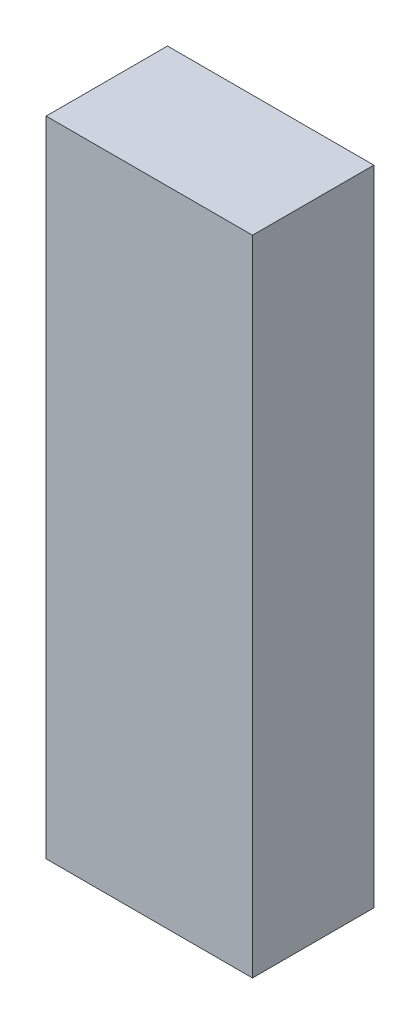
ISO-10303-21;
HEADER;
FILE_DESCRIPTION(('STEP AP214'),'2;1');
FILE_NAME('part.step','',(''),(''),'','','');
FILE_SCHEMA(('AUTOMOTIVE_DESIGN { 1 0 10303 214 1 1 1 1 }'));
ENDSEC;
DATA;
#1=APPLICATION_CONTEXT('core data for automotive mechanical design processes');
#2=APPLICATION_PROTOCOL_DEFINITION('international standard','automotive_design',2000,#1);
#3=PRODUCT_CONTEXT('',#1,'mechanical');
#4=PRODUCT('Part','Part','',(#3));
#5=PRODUCT_RELATED_PRODUCT_CATEGORY('part','',(#4));
#6=PRODUCT_DEFINITION_FORMATION('','',#4);
#7=PRODUCT_DEFINITION_CONTEXT('part definition',#1,'design');
#8=PRODUCT_DEFINITION('design','',#6,#7);
#9=PRODUCT_DEFINITION_SHAPE('','',#8);
#10=(LENGTH_UNIT() NAMED_UNIT(*) SI_UNIT(.MILLI.,.METRE.));
#11=(NAMED_UNIT(*) PLANE_ANGLE_UNIT() SI_UNIT($,.RADIAN.));
#12=(NAMED_UNIT(*) SI_UNIT($,.STERADIAN.) SOLID_ANGLE_UNIT());
#13=UNCERTAINTY_MEASURE_WITH_UNIT(LENGTH_MEASURE(1.E-05),#10,'distance_accuracy_value','');
#14=(GEOMETRIC_REPRESENTATION_CONTEXT(3) GLOBAL_UNCERTAINTY_ASSIGNED_CONTEXT((#13)) GLOBAL_UNIT_ASSIGNED_CONTEXT((#10,
#11,#12)) REPRESENTATION_CONTEXT('',''));
#15=CARTESIAN_POINT('',(0.,0.,0.));
#16=DIRECTION('',(0.,0.,1.));
#17=DIRECTION('',(1.,0.,0.));
#18=AXIS2_PLACEMENT_3D('',#15,#16,#17);
#19=CARTESIAN_POINT('',(0.,106.,20.));
#20=DIRECTION('',(1.,0.,0.));
#21=DIRECTION('',(0.,0.,-1.));
#22=AXIS2_PLACEMENT_3D('',#19,#20,#21);
#23=PLANE('',#22);
#24=DIRECTION('',(0.,-1.,0.));
#25=VECTOR('',#24,1.);
#26=CARTESIAN_POINT('',(0.,106.,0.));
#27=LINE('',#26,#25);
#28=CARTESIAN_POINT('',(0.,106.,0.));
#29=VERTEX_POINT('',#28);
#30=CARTESIAN_POINT('',(0.,0.,0.));
#31=VERTEX_POINT('',#30);
#32=EDGE_CURVE('E96',#29,#31,#27,.T.);
#33=ORIENTED_EDGE('',*,*,#32,.T.);
#34=DIRECTION('',(0.,0.,-1.));
#35=VECTOR('',#34,1.);
#36=CARTESIAN_POINT('',(0.,0.,20.));
#37=LINE('',#36,#35);
#38=CARTESIAN_POINT('',(0.,0.,20.));
#39=VERTEX_POINT('',#38);
#40=EDGE_CURVE('E11',#39,#31,#37,.T.);
#41=ORIENTED_EDGE('',*,*,#40,.F.);
#42=DIRECTION('',(0.,-1.,0.));
#43=VECTOR('',#42,1.);
#44=CARTESIAN_POINT('',(0.,106.,20.));
#45=LINE('',#44,#43);
#46=CARTESIAN_POINT('',(0.,106.,20.));
#47=VERTEX_POINT('',#46);
#48=EDGE_CURVE('E84',#47,#39,#45,.T.);
#49=ORIENTED_EDGE('',*,*,#48,.F.);
#50=DIRECTION('',(0.,0.,-1.));
#51=VECTOR('',#50,1.);
#52=CARTESIAN_POINT('',(0.,106.,20.));
#53=LINE('',#52,#51);
#54=EDGE_CURVE('E92',#47,#29,#53,.T.);
#55=ORIENTED_EDGE('',*,*,#54,.T.);
#56=EDGE_LOOP('',(#33,#41,#49,#55));
#57=FACE_BOUND('',#56,.T.);
#58=ADVANCED_FACE('F33',(#57),#23,.F.);
#59=CARTESIAN_POINT('',(0.,0.,20.));
#60=DIRECTION('',(0.,1.,0.));
#61=DIRECTION('',(0.,0.,1.));
#62=AXIS2_PLACEMENT_3D('',#59,#60,#61);
#63=PLANE('',#62);
#64=DIRECTION('',(1.,0.,0.));
#65=VECTOR('',#64,1.);
#66=CARTESIAN_POINT('',(0.,0.,0.));
#67=LINE('',#66,#65);
#68=CARTESIAN_POINT('',(34.,0.,0.));
#69=VERTEX_POINT('',#68);
#70=EDGE_CURVE('E88',#31,#69,#67,.T.);
#71=ORIENTED_EDGE('',*,*,#70,.T.);
#72=DIRECTION('',(0.,0.,-1.));
#73=VECTOR('',#72,1.);
#74=CARTESIAN_POINT('',(34.,0.,20.));
#75=LINE('',#74,#73);
#76=CARTESIAN_POINT('',(34.,0.,20.));
#77=VERTEX_POINT('',#76);
#78=EDGE_CURVE('E41',#77,#69,#75,.T.);
#79=ORIENTED_EDGE('',*,*,#78,.F.);
#80=DIRECTION('',(1.,0.,0.));
#81=VECTOR('',#80,1.);
#82=CARTESIAN_POINT('',(0.,0.,20.));
#83=LINE('',#82,#81);
#84=EDGE_CURVE('E79',#39,#77,#83,.T.);
#85=ORIENTED_EDGE('',*,*,#84,.F.);
#86=ORIENTED_EDGE('',*,*,#40,.T.);
#87=EDGE_LOOP('',(#71,#79,#85,#86));
#88=FACE_BOUND('',#87,.T.);
#89=ADVANCED_FACE('F87',(#88),#63,.F.);
#90=CARTESIAN_POINT('',(34.,0.,20.));
#91=DIRECTION('',(-1.,0.,0.));
#92=DIRECTION('',(0.,0.,1.));
#93=AXIS2_PLACEMENT_3D('',#90,#91,#92);
#94=PLANE('',#93);
#95=DIRECTION('',(0.,1.,0.));
#96=VECTOR('',#95,1.);
#97=CARTESIAN_POINT('',(34.,0.,0.));
#98=LINE('',#97,#96);
#99=CARTESIAN_POINT('',(34.,106.,0.));
#100=VERTEX_POINT('',#99);
#101=EDGE_CURVE('E66',#69,#100,#98,.T.);
#102=ORIENTED_EDGE('',*,*,#101,.T.);
#103=DIRECTION('',(0.,0.,-1.));
#104=VECTOR('',#103,1.);
#105=CARTESIAN_POINT('',(34.,106.,20.));
#106=LINE('',#105,#104);
#107=CARTESIAN_POINT('',(34.,106.,20.));
#108=VERTEX_POINT('',#107);
#109=EDGE_CURVE('E89',#108,#100,#106,.T.);
#110=ORIENTED_EDGE('',*,*,#109,.F.);
#111=DIRECTION('',(0.,1.,0.));
#112=VECTOR('',#111,1.);
#113=CARTESIAN_POINT('',(34.,0.,20.));
#114=LINE('',#113,#112);
#115=EDGE_CURVE('E82',#77,#108,#114,.T.);
#116=ORIENTED_EDGE('',*,*,#115,.F.);
#117=ORIENTED_EDGE('',*,*,#78,.T.);
#118=EDGE_LOOP('',(#102,#110,#116,#117));
#119=FACE_BOUND('',#118,.T.);
#120=ADVANCED_FACE('F90',(#119),#94,.F.);
#121=CARTESIAN_POINT('',(34.,106.,20.));
#122=DIRECTION('',(0.,-1.,0.));
#123=DIRECTION('',(0.,0.,-1.));
#124=AXIS2_PLACEMENT_3D('',#121,#122,#123);
#125=PLANE('',#124);
#126=DIRECTION('',(-1.,0.,0.));
#127=VECTOR('',#126,1.);
#128=CARTESIAN_POINT('',(34.,106.,0.));
#129=LINE('',#128,#127);
#130=EDGE_CURVE('E72',#100,#29,#129,.T.);
#131=ORIENTED_EDGE('',*,*,#130,.T.);
#132=ORIENTED_EDGE('',*,*,#54,.F.);
#133=DIRECTION('',(-1.,0.,0.));
#134=VECTOR('',#133,1.);
#135=CARTESIAN_POINT('',(34.,106.,20.));
#136=LINE('',#135,#134);
#137=EDGE_CURVE('E49',#108,#47,#136,.T.);
#138=ORIENTED_EDGE('',*,*,#137,.F.);
#139=ORIENTED_EDGE('',*,*,#109,.T.);
#140=EDGE_LOOP('',(#131,#132,#138,#139));
#141=FACE_BOUND('',#140,.T.);
#142=ADVANCED_FACE('F103',(#141),#125,.F.);
#143=CARTESIAN_POINT('',(0.,0.,20.));
#144=DIRECTION('',(0.,0.,1.));
#145=DIRECTION('',(1.,0.,0.));
#146=AXIS2_PLACEMENT_3D('',#143,#144,#145);
#147=PLANE('',#146);
#148=ORIENTED_EDGE('',*,*,#48,.T.);
#149=ORIENTED_EDGE('',*,*,#84,.T.);
#150=ORIENTED_EDGE('',*,*,#115,.T.);
#151=ORIENTED_EDGE('',*,*,#137,.T.);
#152=EDGE_LOOP('',(#148,#149,#150,#151));
#153=FACE_BOUND('',#152,.T.);
#154=ADVANCED_FACE('F80',(#153),#147,.T.);
#155=CARTESIAN_POINT('',(0.,0.,0.));
#156=DIRECTION('',(0.,0.,1.));
#157=DIRECTION('',(1.,0.,0.));
#158=AXIS2_PLACEMENT_3D('',#155,#156,#157);
#159=PLANE('',#158);
#160=ORIENTED_EDGE('',*,*,#32,.F.);
#161=ORIENTED_EDGE('',*,*,#130,.F.);
#162=ORIENTED_EDGE('',*,*,#101,.F.);
#163=ORIENTED_EDGE('',*,*,#70,.F.);
#164=EDGE_LOOP('',(#160,#161,#162,#163));
#165=FACE_BOUND('',#164,.T.);
#166=ADVANCED_FACE('F106',(#165),#159,.F.);
#167=CLOSED_SHELL('',(#58,#89,#120,#142,#154,#166));
#168=MANIFOLD_SOLID_BREP('B2',#167);
#169=ADVANCED_BREP_SHAPE_REPRESENTATION('',(#18,#168),#14);
#170=SHAPE_DEFINITION_REPRESENTATION(#9,#169);
ENDSEC;
END-ISO-10303-21;
